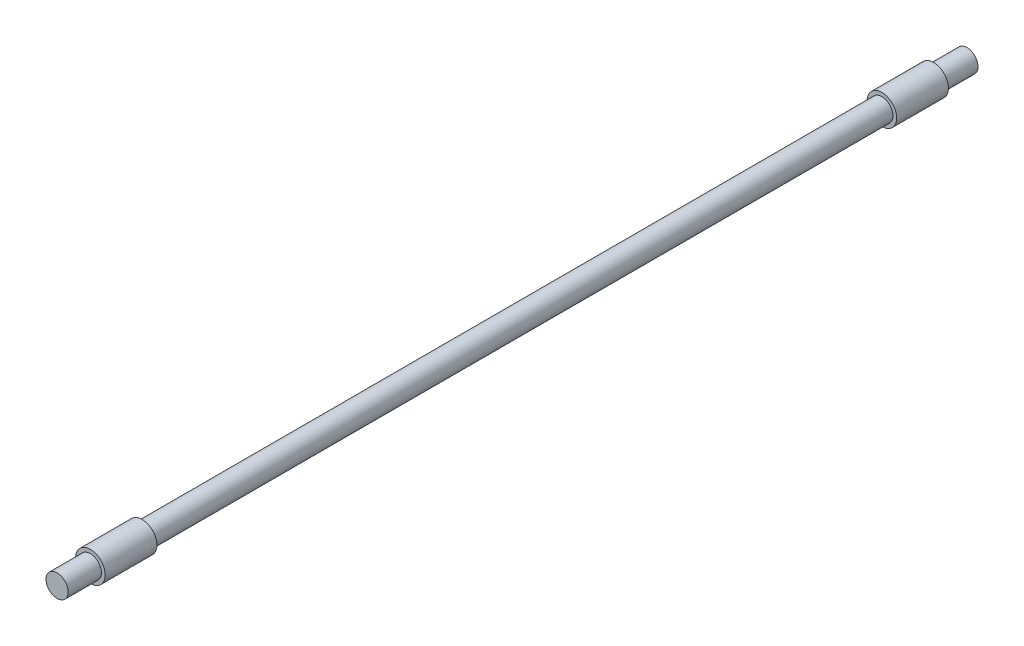
ISO-10303-21;
HEADER;
FILE_DESCRIPTION(('STEP AP214'),'2;1');
FILE_NAME('part.step','',(''),(''),'','','');
FILE_SCHEMA(('AUTOMOTIVE_DESIGN { 1 0 10303 214 1 1 1 1 }'));
ENDSEC;
DATA;
#1=APPLICATION_CONTEXT('core data for automotive mechanical design processes');
#2=APPLICATION_PROTOCOL_DEFINITION('international standard','automotive_design',2000,#1);
#3=PRODUCT_CONTEXT('',#1,'mechanical');
#4=PRODUCT('Part','Part','',(#3));
#5=PRODUCT_RELATED_PRODUCT_CATEGORY('part','',(#4));
#6=PRODUCT_DEFINITION_FORMATION('','',#4);
#7=PRODUCT_DEFINITION_CONTEXT('part definition',#1,'design');
#8=PRODUCT_DEFINITION('design','',#6,#7);
#9=PRODUCT_DEFINITION_SHAPE('','',#8);
#10=(LENGTH_UNIT() NAMED_UNIT(*) SI_UNIT(.MILLI.,.METRE.));
#11=(NAMED_UNIT(*) PLANE_ANGLE_UNIT() SI_UNIT($,.RADIAN.));
#12=(NAMED_UNIT(*) SI_UNIT($,.STERADIAN.) SOLID_ANGLE_UNIT());
#13=UNCERTAINTY_MEASURE_WITH_UNIT(LENGTH_MEASURE(1.E-05),#10,'distance_accuracy_value','');
#14=(GEOMETRIC_REPRESENTATION_CONTEXT(3) GLOBAL_UNCERTAINTY_ASSIGNED_CONTEXT((#13)) GLOBAL_UNIT_ASSIGNED_CONTEXT((#10,
#11,#12)) REPRESENTATION_CONTEXT('',''));
#15=CARTESIAN_POINT('',(0.,0.,0.));
#16=DIRECTION('',(0.,0.,1.));
#17=DIRECTION('',(1.,0.,0.));
#18=AXIS2_PLACEMENT_3D('',#15,#16,#17);
#19=CARTESIAN_POINT('',(0.,0.,1000.));
#20=DIRECTION('',(0.,0.,-1.));
#21=DIRECTION('',(-1.,0.,0.));
#22=AXIS2_PLACEMENT_3D('',#19,#20,#21);
#23=CYLINDRICAL_SURFACE('',#22,15.);
#24=CARTESIAN_POINT('',(0.,0.,1000.));
#25=DIRECTION('',(0.,0.,1.));
#26=DIRECTION('',(1.,0.,0.));
#27=AXIS2_PLACEMENT_3D('',#24,#25,#26);
#28=CIRCLE('',#27,15.);
#29=CARTESIAN_POINT('',(15.,0.,1000.));
#30=VERTEX_POINT('',#29);
#31=EDGE_CURVE('E10',#30,#30,#28,.T.);
#32=ORIENTED_EDGE('',*,*,#31,.F.);
#33=EDGE_LOOP('',(#32));
#34=FACE_BOUND('',#33,.T.);
#35=CARTESIAN_POINT('',(0.,0.,0.));
#36=DIRECTION('',(0.,0.,-1.));
#37=DIRECTION('',(-1.,0.,0.));
#38=AXIS2_PLACEMENT_3D('',#35,#36,#37);
#39=CIRCLE('',#38,15.);
#40=CARTESIAN_POINT('',(-15.,0.,0.));
#41=VERTEX_POINT('',#40);
#42=EDGE_CURVE('E57',#41,#41,#39,.T.);
#43=ORIENTED_EDGE('',*,*,#42,.F.);
#44=EDGE_LOOP('',(#43));
#45=FACE_BOUND('',#44,.T.);
#46=ADVANCED_FACE('F37',(#34,#45),#23,.T.);
#47=CARTESIAN_POINT('',(0.,0.,1070.));
#48=DIRECTION('',(0.,0.,-1.));
#49=DIRECTION('',(-1.,0.,0.));
#50=AXIS2_PLACEMENT_3D('',#47,#48,#49);
#51=CYLINDRICAL_SURFACE('',#50,20.);
#52=CARTESIAN_POINT('',(0.,0.,1070.));
#53=DIRECTION('',(0.,0.,1.));
#54=DIRECTION('',(1.,0.,0.));
#55=AXIS2_PLACEMENT_3D('',#52,#53,#54);
#56=CIRCLE('',#55,20.);
#57=CARTESIAN_POINT('',(20.,0.,1070.));
#58=VERTEX_POINT('',#57);
#59=EDGE_CURVE('E43',#58,#58,#56,.T.);
#60=ORIENTED_EDGE('',*,*,#59,.F.);
#61=EDGE_LOOP('',(#60));
#62=FACE_BOUND('',#61,.T.);
#63=CARTESIAN_POINT('',(0.,0.,1000.));
#64=DIRECTION('',(0.,0.,1.));
#65=DIRECTION('',(1.,0.,0.));
#66=AXIS2_PLACEMENT_3D('',#63,#64,#65);
#67=CIRCLE('',#66,20.);
#68=CARTESIAN_POINT('',(20.,0.,1000.));
#69=VERTEX_POINT('',#68);
#70=EDGE_CURVE('E47',#69,#69,#67,.T.);
#71=ORIENTED_EDGE('',*,*,#70,.T.);
#72=EDGE_LOOP('',(#71));
#73=FACE_BOUND('',#72,.T.);
#74=ADVANCED_FACE('F103',(#62,#73),#51,.T.);
#75=CARTESIAN_POINT('',(0.,0.,1070.));
#76=DIRECTION('',(0.,0.,1.));
#77=DIRECTION('',(1.,0.,0.));
#78=AXIS2_PLACEMENT_3D('',#75,#76,#77);
#79=PLANE('',#78);
#80=CARTESIAN_POINT('',(0.,0.,1070.));
#81=DIRECTION('',(0.,0.,1.));
#82=DIRECTION('',(1.,0.,0.));
#83=AXIS2_PLACEMENT_3D('',#80,#81,#82);
#84=CIRCLE('',#83,15.);
#85=CARTESIAN_POINT('',(15.,0.,1070.));
#86=VERTEX_POINT('',#85);
#87=EDGE_CURVE('E54',#86,#86,#84,.T.);
#88=ORIENTED_EDGE('',*,*,#87,.F.);
#89=EDGE_LOOP('',(#88));
#90=FACE_BOUND('',#89,.T.);
#91=ORIENTED_EDGE('',*,*,#59,.T.);
#92=EDGE_LOOP('',(#91));
#93=FACE_BOUND('',#92,.T.);
#94=ADVANCED_FACE('F108',(#90,#93),#79,.T.);
#95=CARTESIAN_POINT('',(0.,0.,1000.));
#96=DIRECTION('',(0.,0.,1.));
#97=DIRECTION('',(1.,0.,0.));
#98=AXIS2_PLACEMENT_3D('',#95,#96,#97);
#99=PLANE('',#98);
#100=ORIENTED_EDGE('',*,*,#31,.T.);
#101=EDGE_LOOP('',(#100));
#102=FACE_BOUND('',#101,.T.);
#103=ORIENTED_EDGE('',*,*,#70,.F.);
#104=EDGE_LOOP('',(#103));
#105=FACE_BOUND('',#104,.T.);
#106=ADVANCED_FACE('F116',(#102,#105),#99,.F.);
#107=CARTESIAN_POINT('',(0.,0.,1115.));
#108=DIRECTION('',(0.,0.,-1.));
#109=DIRECTION('',(-1.,0.,0.));
#110=AXIS2_PLACEMENT_3D('',#107,#108,#109);
#111=CYLINDRICAL_SURFACE('',#110,15.);
#112=CARTESIAN_POINT('',(0.,0.,1115.));
#113=DIRECTION('',(0.,0.,1.));
#114=DIRECTION('',(1.,0.,0.));
#115=AXIS2_PLACEMENT_3D('',#112,#113,#114);
#116=CIRCLE('',#115,15.);
#117=CARTESIAN_POINT('',(15.,0.,1115.));
#118=VERTEX_POINT('',#117);
#119=EDGE_CURVE('E52',#118,#118,#116,.T.);
#120=ORIENTED_EDGE('',*,*,#119,.F.);
#121=EDGE_LOOP('',(#120));
#122=FACE_BOUND('',#121,.T.);
#123=ORIENTED_EDGE('',*,*,#87,.T.);
#124=EDGE_LOOP('',(#123));
#125=FACE_BOUND('',#124,.T.);
#126=ADVANCED_FACE('F121',(#122,#125),#111,.T.);
#127=CARTESIAN_POINT('',(0.,0.,1115.));
#128=DIRECTION('',(0.,0.,1.));
#129=DIRECTION('',(1.,0.,0.));
#130=AXIS2_PLACEMENT_3D('',#127,#128,#129);
#131=PLANE('',#130);
#132=ORIENTED_EDGE('',*,*,#119,.T.);
#133=EDGE_LOOP('',(#132));
#134=FACE_BOUND('',#133,.T.);
#135=ADVANCED_FACE('F93',(#134),#131,.T.);
#136=CARTESIAN_POINT('',(0.,0.,-70.));
#137=DIRECTION('',(0.,0.,1.));
#138=DIRECTION('',(1.,0.,0.));
#139=AXIS2_PLACEMENT_3D('',#136,#137,#138);
#140=CYLINDRICAL_SURFACE('',#139,20.);
#141=CARTESIAN_POINT('',(0.,0.,-70.));
#142=DIRECTION('',(0.,0.,-1.));
#143=DIRECTION('',(-1.,0.,0.));
#144=AXIS2_PLACEMENT_3D('',#141,#142,#143);
#145=CIRCLE('',#144,20.);
#146=CARTESIAN_POINT('',(-20.,0.,-70.));
#147=VERTEX_POINT('',#146);
#148=EDGE_CURVE('E62',#147,#147,#145,.T.);
#149=ORIENTED_EDGE('',*,*,#148,.F.);
#150=EDGE_LOOP('',(#149));
#151=FACE_BOUND('',#150,.T.);
#152=CARTESIAN_POINT('',(0.,0.,0.));
#153=DIRECTION('',(0.,0.,-1.));
#154=DIRECTION('',(-1.,0.,0.));
#155=AXIS2_PLACEMENT_3D('',#152,#153,#154);
#156=CIRCLE('',#155,20.);
#157=CARTESIAN_POINT('',(-20.,0.,0.));
#158=VERTEX_POINT('',#157);
#159=EDGE_CURVE('E63',#158,#158,#156,.T.);
#160=ORIENTED_EDGE('',*,*,#159,.T.);
#161=EDGE_LOOP('',(#160));
#162=FACE_BOUND('',#161,.T.);
#163=ADVANCED_FACE('F87',(#151,#162),#140,.T.);
#164=CARTESIAN_POINT('',(0.,0.,-70.));
#165=DIRECTION('',(0.,0.,-1.));
#166=DIRECTION('',(-1.,0.,0.));
#167=AXIS2_PLACEMENT_3D('',#164,#165,#166);
#168=PLANE('',#167);
#169=CARTESIAN_POINT('',(0.,0.,-70.));
#170=DIRECTION('',(0.,0.,-1.));
#171=DIRECTION('',(-1.,0.,0.));
#172=AXIS2_PLACEMENT_3D('',#169,#170,#171);
#173=CIRCLE('',#172,15.);
#174=CARTESIAN_POINT('',(-15.,0.,-70.));
#175=VERTEX_POINT('',#174);
#176=EDGE_CURVE('E69',#175,#175,#173,.T.);
#177=ORIENTED_EDGE('',*,*,#176,.F.);
#178=EDGE_LOOP('',(#177));
#179=FACE_BOUND('',#178,.T.);
#180=ORIENTED_EDGE('',*,*,#148,.T.);
#181=EDGE_LOOP('',(#180));
#182=FACE_BOUND('',#181,.T.);
#183=ADVANCED_FACE('F84',(#179,#182),#168,.T.);
#184=CARTESIAN_POINT('',(0.,0.,0.));
#185=DIRECTION('',(0.,0.,-1.));
#186=DIRECTION('',(-1.,0.,0.));
#187=AXIS2_PLACEMENT_3D('',#184,#185,#186);
#188=PLANE('',#187);
#189=ORIENTED_EDGE('',*,*,#42,.T.);
#190=EDGE_LOOP('',(#189));
#191=FACE_BOUND('',#190,.T.);
#192=ORIENTED_EDGE('',*,*,#159,.F.);
#193=EDGE_LOOP('',(#192));
#194=FACE_BOUND('',#193,.T.);
#195=ADVANCED_FACE('F80',(#191,#194),#188,.F.);
#196=CARTESIAN_POINT('',(0.,0.,-115.));
#197=DIRECTION('',(0.,0.,1.));
#198=DIRECTION('',(1.,0.,0.));
#199=AXIS2_PLACEMENT_3D('',#196,#197,#198);
#200=CYLINDRICAL_SURFACE('',#199,15.);
#201=CARTESIAN_POINT('',(0.,0.,-115.));
#202=DIRECTION('',(0.,0.,-1.));
#203=DIRECTION('',(-1.,0.,0.));
#204=AXIS2_PLACEMENT_3D('',#201,#202,#203);
#205=CIRCLE('',#204,15.);
#206=CARTESIAN_POINT('',(-15.,0.,-115.));
#207=VERTEX_POINT('',#206);
#208=EDGE_CURVE('E66',#207,#207,#205,.T.);
#209=ORIENTED_EDGE('',*,*,#208,.F.);
#210=EDGE_LOOP('',(#209));
#211=FACE_BOUND('',#210,.T.);
#212=ORIENTED_EDGE('',*,*,#176,.T.);
#213=EDGE_LOOP('',(#212));
#214=FACE_BOUND('',#213,.T.);
#215=ADVANCED_FACE('F77',(#211,#214),#200,.T.);
#216=CARTESIAN_POINT('',(0.,0.,-115.));
#217=DIRECTION('',(0.,0.,-1.));
#218=DIRECTION('',(-1.,0.,0.));
#219=AXIS2_PLACEMENT_3D('',#216,#217,#218);
#220=PLANE('',#219);
#221=ORIENTED_EDGE('',*,*,#208,.T.);
#222=EDGE_LOOP('',(#221));
#223=FACE_BOUND('',#222,.T.);
#224=ADVANCED_FACE('F75',(#223),#220,.T.);
#225=CLOSED_SHELL('',(#46,#74,#94,#106,#126,#135,#163,#183,#195,#215,#224));
#226=MANIFOLD_SOLID_BREP('B2',#225);
#227=ADVANCED_BREP_SHAPE_REPRESENTATION('',(#18,#226),#14);
#228=SHAPE_DEFINITION_REPRESENTATION(#9,#227);
ENDSEC;
END-ISO-10303-21;
